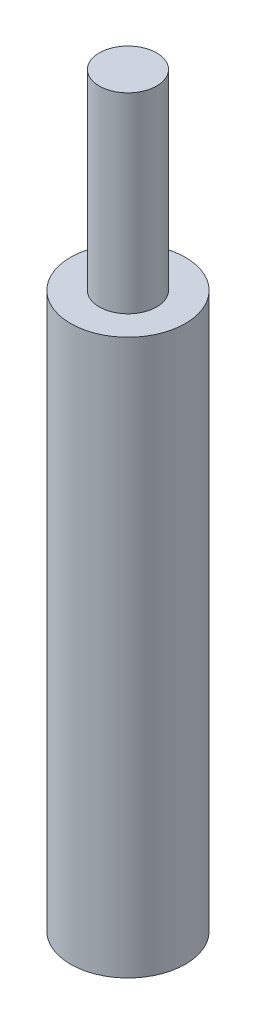
ISO-10303-21;
HEADER;
FILE_DESCRIPTION(('STEP AP214'),'2;1');
FILE_NAME('part.step','',(''),(''),'','','');
FILE_SCHEMA(('AUTOMOTIVE_DESIGN { 1 0 10303 214 1 1 1 1 }'));
ENDSEC;
DATA;
#1=APPLICATION_CONTEXT('core data for automotive mechanical design processes');
#2=APPLICATION_PROTOCOL_DEFINITION('international standard','automotive_design',2000,#1);
#3=PRODUCT_CONTEXT('',#1,'mechanical');
#4=PRODUCT('Part','Part','',(#3));
#5=PRODUCT_RELATED_PRODUCT_CATEGORY('part','',(#4));
#6=PRODUCT_DEFINITION_FORMATION('','',#4);
#7=PRODUCT_DEFINITION_CONTEXT('part definition',#1,'design');
#8=PRODUCT_DEFINITION('design','',#6,#7);
#9=PRODUCT_DEFINITION_SHAPE('','',#8);
#10=(LENGTH_UNIT() NAMED_UNIT(*) SI_UNIT(.MILLI.,.METRE.));
#11=(NAMED_UNIT(*) PLANE_ANGLE_UNIT() SI_UNIT($,.RADIAN.));
#12=(NAMED_UNIT(*) SI_UNIT($,.STERADIAN.) SOLID_ANGLE_UNIT());
#13=UNCERTAINTY_MEASURE_WITH_UNIT(LENGTH_MEASURE(1.E-05),#10,'distance_accuracy_value','');
#14=(GEOMETRIC_REPRESENTATION_CONTEXT(3) GLOBAL_UNCERTAINTY_ASSIGNED_CONTEXT((#13)) GLOBAL_UNIT_ASSIGNED_CONTEXT((#10,
#11,#12)) REPRESENTATION_CONTEXT('',''));
#15=CARTESIAN_POINT('',(0.,0.,0.));
#16=DIRECTION('',(0.,0.,1.));
#17=DIRECTION('',(1.,0.,0.));
#18=AXIS2_PLACEMENT_3D('',#15,#16,#17);
#19=CARTESIAN_POINT('',(0.,29.,0.));
#20=DIRECTION('',(0.,1.,0.));
#21=DIRECTION('',(0.,0.,1.));
#22=AXIS2_PLACEMENT_3D('',#19,#20,#21);
#23=PLANE('',#22);
#24=CARTESIAN_POINT('',(0.,29.,0.));
#25=DIRECTION('',(0.,1.,0.));
#26=DIRECTION('',(0.,0.,1.));
#27=AXIS2_PLACEMENT_3D('',#24,#25,#26);
#28=CIRCLE('',#27,3.);
#29=CARTESIAN_POINT('',(0.,29.,3.));
#30=VERTEX_POINT('',#29);
#31=EDGE_CURVE('E11',#30,#30,#28,.T.);
#32=ORIENTED_EDGE('',*,*,#31,.T.);
#33=EDGE_LOOP('',(#32));
#34=FACE_BOUND('',#33,.T.);
#35=CARTESIAN_POINT('',(0.,29.,0.));
#36=DIRECTION('',(0.,1.,0.));
#37=DIRECTION('',(0.,0.,1.));
#38=AXIS2_PLACEMENT_3D('',#35,#36,#37);
#39=CIRCLE('',#38,1.5);
#40=CARTESIAN_POINT('',(0.,29.,1.5));
#41=VERTEX_POINT('',#40);
#42=EDGE_CURVE('E57',#41,#41,#39,.T.);
#43=ORIENTED_EDGE('',*,*,#42,.F.);
#44=EDGE_LOOP('',(#43));
#45=FACE_BOUND('',#44,.T.);
#46=ADVANCED_FACE('F37',(#34,#45),#23,.T.);
#47=CARTESIAN_POINT('',(0.,29.,0.));
#48=DIRECTION('',(0.,-1.,0.));
#49=DIRECTION('',(0.,0.,-1.));
#50=AXIS2_PLACEMENT_3D('',#47,#48,#49);
#51=CYLINDRICAL_SURFACE('',#50,3.);
#52=ORIENTED_EDGE('',*,*,#31,.F.);
#53=EDGE_LOOP('',(#52));
#54=FACE_BOUND('',#53,.T.);
#55=CARTESIAN_POINT('',(0.,0.,0.));
#56=DIRECTION('',(0.,1.,0.));
#57=DIRECTION('',(0.,0.,1.));
#58=AXIS2_PLACEMENT_3D('',#55,#56,#57);
#59=CIRCLE('',#58,3.);
#60=CARTESIAN_POINT('',(0.,0.,3.));
#61=VERTEX_POINT('',#60);
#62=EDGE_CURVE('E41',#61,#61,#59,.T.);
#63=ORIENTED_EDGE('',*,*,#62,.T.);
#64=EDGE_LOOP('',(#63));
#65=FACE_BOUND('',#64,.T.);
#66=ADVANCED_FACE('F39',(#54,#65),#51,.T.);
#67=CARTESIAN_POINT('',(0.,0.,0.));
#68=DIRECTION('',(0.,1.,0.));
#69=DIRECTION('',(0.,0.,1.));
#70=AXIS2_PLACEMENT_3D('',#67,#68,#69);
#71=PLANE('',#70);
#72=CARTESIAN_POINT('',(0.,-1.25767452008319E-13,0.));
#73=DIRECTION('',(0.,-1.,0.));
#74=DIRECTION('',(0.,0.,-1.));
#75=AXIS2_PLACEMENT_3D('',#72,#73,#74);
#76=CIRCLE('',#75,1.525);
#77=CARTESIAN_POINT('',(0.,-1.25767452008319E-13,-1.525));
#78=VERTEX_POINT('',#77);
#79=EDGE_CURVE('E64',#78,#78,#76,.T.);
#80=ORIENTED_EDGE('',*,*,#79,.F.);
#81=EDGE_LOOP('',(#80));
#82=FACE_BOUND('',#81,.T.);
#83=ORIENTED_EDGE('',*,*,#62,.F.);
#84=EDGE_LOOP('',(#83));
#85=FACE_BOUND('',#84,.T.);
#86=ADVANCED_FACE('F75',(#82,#85),#71,.F.);
#87=CARTESIAN_POINT('',(0.,39.,0.));
#88=DIRECTION('',(0.,-1.,0.));
#89=DIRECTION('',(0.,0.,-1.));
#90=AXIS2_PLACEMENT_3D('',#87,#88,#89);
#91=CYLINDRICAL_SURFACE('',#90,1.5);
#92=CARTESIAN_POINT('',(0.,39.,0.));
#93=DIRECTION('',(0.,1.,0.));
#94=DIRECTION('',(0.,0.,1.));
#95=AXIS2_PLACEMENT_3D('',#92,#93,#94);
#96=CIRCLE('',#95,1.5);
#97=CARTESIAN_POINT('',(0.,39.,1.5));
#98=VERTEX_POINT('',#97);
#99=EDGE_CURVE('E61',#98,#98,#96,.T.);
#100=ORIENTED_EDGE('',*,*,#99,.F.);
#101=EDGE_LOOP('',(#100));
#102=FACE_BOUND('',#101,.T.);
#103=ORIENTED_EDGE('',*,*,#42,.T.);
#104=EDGE_LOOP('',(#103));
#105=FACE_BOUND('',#104,.T.);
#106=ADVANCED_FACE('F77',(#102,#105),#91,.T.);
#107=CARTESIAN_POINT('',(0.,39.,0.));
#108=DIRECTION('',(0.,1.,0.));
#109=DIRECTION('',(0.,0.,1.));
#110=AXIS2_PLACEMENT_3D('',#107,#108,#109);
#111=PLANE('',#110);
#112=ORIENTED_EDGE('',*,*,#99,.T.);
#113=EDGE_LOOP('',(#112));
#114=FACE_BOUND('',#113,.T.);
#115=ADVANCED_FACE('F51',(#114),#111,.T.);
#116=CARTESIAN_POINT('',(0.,5.,0.));
#117=DIRECTION('',(0.,-1.,0.));
#118=DIRECTION('',(0.,0.,-1.));
#119=AXIS2_PLACEMENT_3D('',#116,#117,#118);
#120=CONICAL_SURFACE('',#119,1.25,1.02974425867665);
#121=CARTESIAN_POINT('',(0.,5.75107577378445,0.));
#122=VERTEX_POINT('',#121);
#123=VERTEX_LOOP('',#122);
#124=FACE_BOUND('',#123,.T.);
#125=CARTESIAN_POINT('',(0.,5.,0.));
#126=DIRECTION('',(0.,-1.,0.));
#127=DIRECTION('',(0.,0.,-1.));
#128=AXIS2_PLACEMENT_3D('',#125,#126,#127);
#129=CIRCLE('',#128,1.25);
#130=CARTESIAN_POINT('',(0.,5.,-1.25));
#131=VERTEX_POINT('',#130);
#132=EDGE_CURVE('E55',#131,#131,#129,.T.);
#133=ORIENTED_EDGE('',*,*,#132,.T.);
#134=EDGE_LOOP('',(#133));
#135=FACE_BOUND('',#134,.T.);
#136=ADVANCED_FACE('F47',(#124,#135),#120,.F.);
#137=CARTESIAN_POINT('',(0.,0.,0.));
#138=DIRECTION('',(0.,-1.,0.));
#139=DIRECTION('',(0.,0.,-1.));
#140=AXIS2_PLACEMENT_3D('',#137,#138,#139);
#141=CYLINDRICAL_SURFACE('',#140,1.25);
#142=ORIENTED_EDGE('',*,*,#132,.F.);
#143=EDGE_LOOP('',(#142));
#144=FACE_BOUND('',#143,.T.);
#145=CARTESIAN_POINT('',(0.,0.275000000000002,0.));
#146=DIRECTION('',(0.,-1.,0.));
#147=DIRECTION('',(0.,0.,-1.));
#148=AXIS2_PLACEMENT_3D('',#145,#146,#147);
#149=CIRCLE('',#148,1.25);
#150=CARTESIAN_POINT('',(0.,0.275000000000002,-1.25));
#151=VERTEX_POINT('',#150);
#152=EDGE_CURVE('E58',#151,#151,#149,.T.);
#153=ORIENTED_EDGE('',*,*,#152,.T.);
#154=EDGE_LOOP('',(#153));
#155=FACE_BOUND('',#154,.T.);
#156=ADVANCED_FACE('F50',(#144,#155),#141,.F.);
#157=CARTESIAN_POINT('',(0.,-1.25767452008319E-13,0.));
#158=DIRECTION('',(0.,-1.,0.));
#159=DIRECTION('',(0.,0.,-1.));
#160=AXIS2_PLACEMENT_3D('',#157,#158,#159);
#161=CONICAL_SURFACE('',#160,1.525,0.785398163397215);
#162=ORIENTED_EDGE('',*,*,#152,.F.);
#163=EDGE_LOOP('',(#162));
#164=FACE_BOUND('',#163,.T.);
#165=ORIENTED_EDGE('',*,*,#79,.T.);
#166=EDGE_LOOP('',(#165));
#167=FACE_BOUND('',#166,.T.);
#168=ADVANCED_FACE('F98',(#164,#167),#161,.F.);
#169=CLOSED_SHELL('',(#46,#66,#86,#106,#115,#136,#156,#168));
#170=MANIFOLD_SOLID_BREP('B2',#169);
#171=ADVANCED_BREP_SHAPE_REPRESENTATION('',(#18,#170),#14);
#172=SHAPE_DEFINITION_REPRESENTATION(#9,#171);
ENDSEC;
END-ISO-10303-21;
